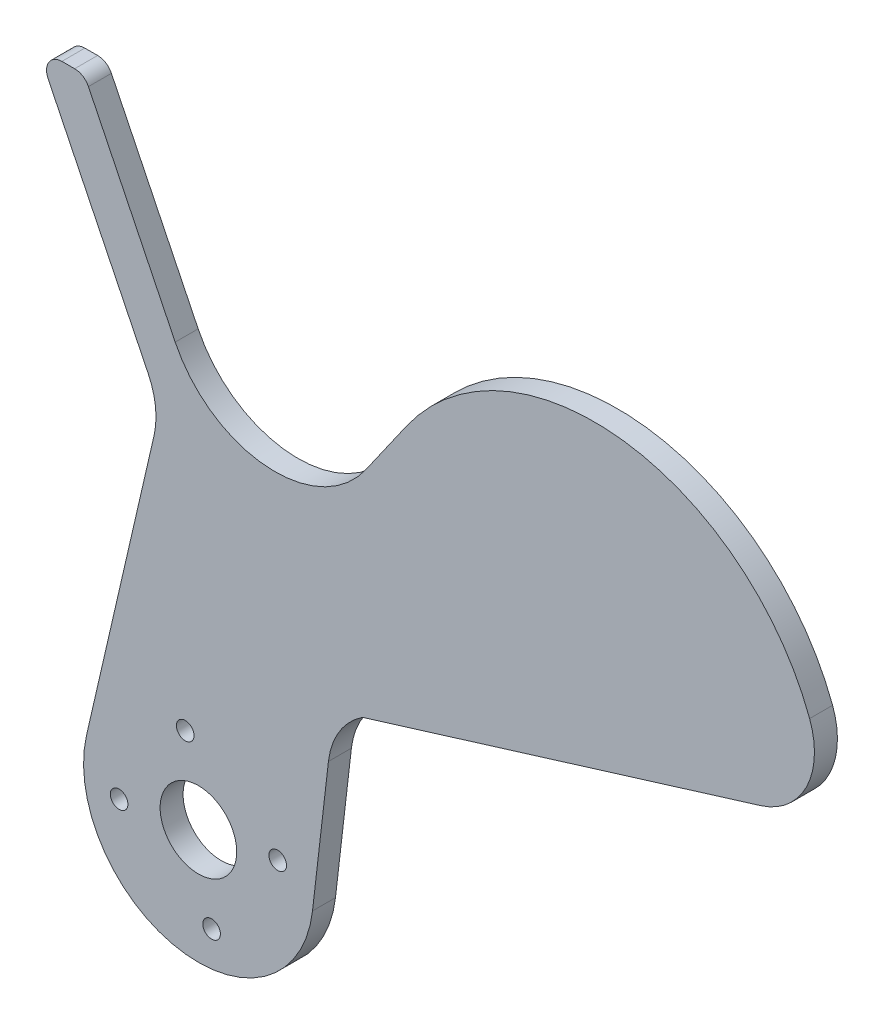
ISO-10303-21;
HEADER;
FILE_DESCRIPTION(('STEP AP214'),'2;1');
FILE_NAME('part.step','',(''),(''),'','','');
FILE_SCHEMA(('AUTOMOTIVE_DESIGN { 1 0 10303 214 1 1 1 1 }'));
ENDSEC;
DATA;
#1=APPLICATION_CONTEXT('core data for automotive mechanical design processes');
#2=APPLICATION_PROTOCOL_DEFINITION('international standard','automotive_design',2000,#1);
#3=PRODUCT_CONTEXT('',#1,'mechanical');
#4=PRODUCT('Part','Part','',(#3));
#5=PRODUCT_RELATED_PRODUCT_CATEGORY('part','',(#4));
#6=PRODUCT_DEFINITION_FORMATION('','',#4);
#7=PRODUCT_DEFINITION_CONTEXT('part definition',#1,'design');
#8=PRODUCT_DEFINITION('design','',#6,#7);
#9=PRODUCT_DEFINITION_SHAPE('','',#8);
#10=(LENGTH_UNIT() NAMED_UNIT(*) SI_UNIT(.MILLI.,.METRE.));
#11=(NAMED_UNIT(*) PLANE_ANGLE_UNIT() SI_UNIT($,.RADIAN.));
#12=(NAMED_UNIT(*) SI_UNIT($,.STERADIAN.) SOLID_ANGLE_UNIT());
#13=UNCERTAINTY_MEASURE_WITH_UNIT(LENGTH_MEASURE(1.E-05),#10,'distance_accuracy_value','');
#14=(GEOMETRIC_REPRESENTATION_CONTEXT(3) GLOBAL_UNCERTAINTY_ASSIGNED_CONTEXT((#13)) GLOBAL_UNIT_ASSIGNED_CONTEXT((#10,
#11,#12)) REPRESENTATION_CONTEXT('',''));
#15=CARTESIAN_POINT('',(0.,0.,0.));
#16=DIRECTION('',(0.,0.,1.));
#17=DIRECTION('',(1.,0.,0.));
#18=AXIS2_PLACEMENT_3D('',#15,#16,#17);
#19=CARTESIAN_POINT('',(-30.1241306273274,-77.2652138906787,3.));
#20=DIRECTION('',(0.,0.,1.));
#21=DIRECTION('',(1.,0.,0.));
#22=AXIS2_PLACEMENT_3D('',#19,#20,#21);
#23=PLANE('',#22);
#24=CARTESIAN_POINT('',(-10.,-60.,3.));
#25=DIRECTION('',(0.,0.,1.));
#26=DIRECTION('',(1.,0.,0.));
#27=AXIS2_PLACEMENT_3D('',#24,#25,#26);
#28=CIRCLE('',#27,5.);
#29=CARTESIAN_POINT('',(-5.,-60.,3.));
#30=VERTEX_POINT('',#29);
#31=EDGE_CURVE('E520',#30,#30,#28,.T.);
#32=ORIENTED_EDGE('',*,*,#31,.F.);
#33=EDGE_LOOP('',(#32));
#34=FACE_BOUND('',#33,.T.);
#35=CARTESIAN_POINT('',(-20.3579106658237,-61.7215361276896,3.));
#36=DIRECTION('',(0.,0.,1.));
#37=DIRECTION('',(1.,0.,0.));
#38=AXIS2_PLACEMENT_3D('',#35,#36,#37);
#39=CIRCLE('',#38,1.15);
#40=CARTESIAN_POINT('',(-19.2079106658237,-61.7215361276896,3.));
#41=VERTEX_POINT('',#40);
#42=EDGE_CURVE('E522',#41,#41,#39,.T.);
#43=ORIENTED_EDGE('',*,*,#42,.F.);
#44=EDGE_LOOP('',(#43));
#45=FACE_BOUND('',#44,.T.);
#46=CARTESIAN_POINT('',(-11.7215361276938,-49.6420893341836,3.));
#47=DIRECTION('',(0.,0.,1.));
#48=DIRECTION('',(1.,0.,0.));
#49=AXIS2_PLACEMENT_3D('',#46,#47,#48);
#50=CIRCLE('',#49,1.15);
#51=CARTESIAN_POINT('',(-10.5715361276938,-49.6420893341836,3.));
#52=VERTEX_POINT('',#51);
#53=EDGE_CURVE('E530',#52,#52,#50,.T.);
#54=ORIENTED_EDGE('',*,*,#53,.F.);
#55=EDGE_LOOP('',(#54));
#56=FACE_BOUND('',#55,.T.);
#57=CARTESIAN_POINT('',(-8.27846387231771,-70.3579106658195,3.));
#58=DIRECTION('',(0.,0.,1.));
#59=DIRECTION('',(1.,0.,0.));
#60=AXIS2_PLACEMENT_3D('',#57,#58,#59);
#61=CIRCLE('',#60,1.15);
#62=CARTESIAN_POINT('',(-7.12846387231771,-70.3579106658195,3.));
#63=VERTEX_POINT('',#62);
#64=EDGE_CURVE('E536',#63,#63,#61,.T.);
#65=ORIENTED_EDGE('',*,*,#64,.F.);
#66=EDGE_LOOP('',(#65));
#67=FACE_BOUND('',#66,.T.);
#68=CARTESIAN_POINT('',(0.357910665812174,-58.2784638723135,3.));
#69=DIRECTION('',(0.,0.,1.));
#70=DIRECTION('',(1.,0.,0.));
#71=AXIS2_PLACEMENT_3D('',#68,#69,#70);
#72=CIRCLE('',#71,1.15);
#73=CARTESIAN_POINT('',(1.50791066581217,-58.2784638723135,3.));
#74=VERTEX_POINT('',#73);
#75=EDGE_CURVE('E178',#74,#74,#72,.T.);
#76=ORIENTED_EDGE('',*,*,#75,.F.);
#77=EDGE_LOOP('',(#76));
#78=FACE_BOUND('',#77,.T.);
#79=DIRECTION('',(-0.955703991120572,-0.294329545503353,0.));
#80=VECTOR('',#79,1.);
#81=CARTESIAN_POINT('',(11.276413219095,-36.6151250652855,3.));
#82=LINE('',#81,#80);
#83=CARTESIAN_POINT('',(63.4009688004772,-20.562250015717,3.));
#84=VERTEX_POINT('',#83);
#85=CARTESIAN_POINT('',(11.4310193454737,-36.5675107921091,3.));
#86=VERTEX_POINT('',#85);
#87=EDGE_CURVE('E152',#84,#86,#82,.T.);
#88=ORIENTED_EDGE('',*,*,#87,.F.);
#89=CARTESIAN_POINT('',(60.4576733454437,-11.0052101045113,3.));
#90=DIRECTION('',(0.,0.,1.));
#91=DIRECTION('',(1.,0.,0.));
#92=AXIS2_PLACEMENT_3D('',#89,#90,#91);
#93=CIRCLE('',#92,10.);
#94=CARTESIAN_POINT('',(69.8261432621106,-7.50781515676704,3.));
#95=VERTEX_POINT('',#94);
#96=EDGE_CURVE('E58',#84,#95,#93,.T.);
#97=ORIENTED_EDGE('',*,*,#96,.T.);
#98=CARTESIAN_POINT('',(41.72073351211,-17.9999999999998,3.));
#99=DIRECTION('',(0.,0.,-1.));
#100=DIRECTION('',(-1.,0.,0.));
#101=AXIS2_PLACEMENT_3D('',#98,#99,#100);
#102=CIRCLE('',#101,29.9999999999999);
#103=CARTESIAN_POINT('',(17.1461721834403,-0.792706909468565,3.));
#104=VERTEX_POINT('',#103);
#105=EDGE_CURVE('E253',#95,#104,#102,.F.);
#106=ORIENTED_EDGE('',*,*,#105,.T.);
#107=DIRECTION('',(-0.573576436351046,-0.819152044288992,0.));
#108=VECTOR('',#107,1.);
#109=CARTESIAN_POINT('',(17.1461721834403,-0.792706909468616,3.));
#110=LINE('',#109,#108);
#111=CARTESIAN_POINT('',(11.8777046421904,-8.31685832709021,3.));
#112=VERTEX_POINT('',#111);
#113=EDGE_CURVE('E250',#104,#112,#110,.T.);
#114=ORIENTED_EDGE('',*,*,#113,.T.);
#115=CARTESIAN_POINT('',(0.,0.,3.));
#116=DIRECTION('',(0.,0.,1.));
#117=DIRECTION('',(1.,0.,0.));
#118=AXIS2_PLACEMENT_3D('',#115,#116,#117);
#119=CIRCLE('',#118,14.4999999999999);
#120=CARTESIAN_POINT('',(-13.0325136713379,-6.35638162844166,3.));
#121=VERTEX_POINT('',#120);
#122=EDGE_CURVE('E247',#112,#121,#119,.F.);
#123=ORIENTED_EDGE('',*,*,#122,.T.);
#124=DIRECTION('',(-0.438371146789079,0.898794046299166,0.));
#125=VECTOR('',#124,1.);
#126=CARTESIAN_POINT('',(-13.0325136713379,-6.35638162844163,3.));
#127=LINE('',#126,#125);
#128=CARTESIAN_POINT('',(-24.3640653422961,16.8767422935782,3.));
#129=VERTEX_POINT('',#128);
#130=EDGE_CURVE('E244',#121,#129,#127,.T.);
#131=ORIENTED_EDGE('',*,*,#130,.T.);
#132=CARTESIAN_POINT('',(-26.1616534348944,16.0000000000002,3.));
#133=DIRECTION('',(0.,0.,-1.));
#134=DIRECTION('',(0.,1.,0.));
#135=AXIS2_PLACEMENT_3D('',#132,#133,#134);
#136=CIRCLE('',#135,1.99999999999988);
#137=CARTESIAN_POINT('',(-26.1616534348944,18.,3.));
#138=VERTEX_POINT('',#137);
#139=EDGE_CURVE('E241',#129,#138,#136,.F.);
#140=ORIENTED_EDGE('',*,*,#139,.T.);
#141=DIRECTION('',(1.,0.,0.));
#142=VECTOR('',#141,1.);
#143=CARTESIAN_POINT('',(-26.9961048902508,18.,3.));
#144=LINE('',#143,#142);
#145=CARTESIAN_POINT('',(-27.8305563456072,18.,3.));
#146=VERTEX_POINT('',#145);
#147=EDGE_CURVE('E151',#146,#138,#144,.T.);
#148=ORIENTED_EDGE('',*,*,#147,.F.);
#149=CARTESIAN_POINT('',(-27.8305563456072,16.0000000000001,3.));
#150=DIRECTION('',(0.,0.,-1.));
#151=DIRECTION('',(0.,1.,0.));
#152=AXIS2_PLACEMENT_3D('',#149,#150,#151);
#153=CIRCLE('',#152,1.99999999999992);
#154=CARTESIAN_POINT('',(-29.6281444382055,15.1232577064219,3.));
#155=VERTEX_POINT('',#154);
#156=EDGE_CURVE('E187',#146,#155,#153,.F.);
#157=ORIENTED_EDGE('',*,*,#156,.T.);
#158=DIRECTION('',(0.438371146789078,-0.898794046299167,0.));
#159=VECTOR('',#158,1.);
#160=CARTESIAN_POINT('',(-29.6281444382055,15.1232577064218,3.));
#161=LINE('',#160,#159);
#162=CARTESIAN_POINT('',(-16.5509641086419,-11.6889353603076,3.));
#163=VERTEX_POINT('',#162);
#164=EDGE_CURVE('E266',#155,#163,#161,.T.);
#165=ORIENTED_EDGE('',*,*,#164,.T.);
#166=CARTESIAN_POINT('',(-25.5389045716334,-16.0726468281983,3.));
#167=DIRECTION('',(0.,0.,1.));
#168=DIRECTION('',(1.,0.,0.));
#169=AXIS2_PLACEMENT_3D('',#166,#167,#168);
#170=CIRCLE('',#169,9.99999999999986);
#171=CARTESIAN_POINT('',(-15.7939381592978,-18.3166676887181,3.));
#172=VERTEX_POINT('',#171);
#173=EDGE_CURVE('E263',#163,#172,#170,.F.);
#174=ORIENTED_EDGE('',*,*,#173,.T.);
#175=DIRECTION('',(-0.224402086051973,-0.974496641233577,0.));
#176=VECTOR('',#175,1.);
#177=CARTESIAN_POINT('',(-15.7939381592978,-18.3166676887181,3.));
#178=LINE('',#177,#176);
#179=CARTESIAN_POINT('',(-24.6174496185037,-56.6339687092204,3.));
#180=VERTEX_POINT('',#179);
#181=EDGE_CURVE('E260',#172,#180,#178,.T.);
#182=ORIENTED_EDGE('',*,*,#181,.T.);
#183=CARTESIAN_POINT('',(-10.0000000000002,-60.,3.));
#184=DIRECTION('',(0.,0.,-1.));
#185=DIRECTION('',(-1.,0.,0.));
#186=AXIS2_PLACEMENT_3D('',#183,#184,#185);
#187=CIRCLE('',#186,14.9999999999999);
#188=CARTESIAN_POINT('',(4.90012437861466,-61.7280895526025,3.));
#189=VERTEX_POINT('',#188);
#190=EDGE_CURVE('E257',#180,#189,#187,.F.);
#191=ORIENTED_EDGE('',*,*,#190,.T.);
#192=DIRECTION('',(0.1152059701735,0.993341625240976,0.));
#193=VECTOR('',#192,1.);
#194=CARTESIAN_POINT('',(4.90012437861468,-61.7280895526026,3.));
#195=LINE('',#194,#193);
#196=CARTESIAN_POINT('',(6.98202004399696,-43.7773390774448,3.));
#197=VERTEX_POINT('',#196);
#198=EDGE_CURVE('E255',#189,#197,#195,.T.);
#199=ORIENTED_EDGE('',*,*,#198,.T.);
#200=CARTESIAN_POINT('',(16.9154362964067,-44.9293987791798,3.));
#201=DIRECTION('',(0.,0.,1.));
#202=DIRECTION('',(1.,0.,0.));
#203=AXIS2_PLACEMENT_3D('',#200,#201,#202);
#204=CIRCLE('',#203,10.);
#205=EDGE_CURVE('E162',#197,#86,#204,.F.);
#206=ORIENTED_EDGE('',*,*,#205,.T.);
#207=EDGE_LOOP('',(#88,#97,#106,#114,#123,#131,#140,#148,#157,#165,#174,#182,#191,#199,#206));
#208=FACE_BOUND('',#207,.T.);
#209=ADVANCED_FACE('F36',(#34,#45,#56,#67,#78,#208),#23,.T.);
#210=CARTESIAN_POINT('',(55.01,-77.2652138906787,0.));
#211=DIRECTION('',(0.,0.,-1.));
#212=DIRECTION('',(-1.,0.,0.));
#213=AXIS2_PLACEMENT_3D('',#210,#211,#212);
#214=PLANE('',#213);
#215=CARTESIAN_POINT('',(-10.,-60.,0.));
#216=DIRECTION('',(0.,0.,1.));
#217=DIRECTION('',(1.,0.,0.));
#218=AXIS2_PLACEMENT_3D('',#215,#216,#217);
#219=CIRCLE('',#218,5.);
#220=CARTESIAN_POINT('',(-5.,-60.,0.));
#221=VERTEX_POINT('',#220);
#222=EDGE_CURVE('E518',#221,#221,#219,.T.);
#223=ORIENTED_EDGE('',*,*,#222,.T.);
#224=EDGE_LOOP('',(#223));
#225=FACE_BOUND('',#224,.T.);
#226=CARTESIAN_POINT('',(-20.3579106658237,-61.7215361276896,0.));
#227=DIRECTION('',(0.,0.,-1.));
#228=DIRECTION('',(-1.,0.,0.));
#229=AXIS2_PLACEMENT_3D('',#226,#227,#228);
#230=CIRCLE('',#229,1.15);
#231=CARTESIAN_POINT('',(-21.5079106658237,-61.7215361276896,0.));
#232=VERTEX_POINT('',#231);
#233=EDGE_CURVE('E527',#232,#232,#230,.T.);
#234=ORIENTED_EDGE('',*,*,#233,.F.);
#235=EDGE_LOOP('',(#234));
#236=FACE_BOUND('',#235,.T.);
#237=CARTESIAN_POINT('',(-11.7215361276938,-49.6420893341836,0.));
#238=DIRECTION('',(0.,0.,-1.));
#239=DIRECTION('',(-1.,0.,0.));
#240=AXIS2_PLACEMENT_3D('',#237,#238,#239);
#241=CIRCLE('',#240,1.15);
#242=CARTESIAN_POINT('',(-12.8715361276938,-49.6420893341836,0.));
#243=VERTEX_POINT('',#242);
#244=EDGE_CURVE('E533',#243,#243,#241,.T.);
#245=ORIENTED_EDGE('',*,*,#244,.F.);
#246=EDGE_LOOP('',(#245));
#247=FACE_BOUND('',#246,.T.);
#248=CARTESIAN_POINT('',(-8.27846387231771,-70.3579106658195,0.));
#249=DIRECTION('',(0.,0.,-1.));
#250=DIRECTION('',(-1.,0.,0.));
#251=AXIS2_PLACEMENT_3D('',#248,#249,#250);
#252=CIRCLE('',#251,1.15);
#253=CARTESIAN_POINT('',(-9.4284638723177,-70.3579106658195,0.));
#254=VERTEX_POINT('',#253);
#255=EDGE_CURVE('E539',#254,#254,#252,.T.);
#256=ORIENTED_EDGE('',*,*,#255,.F.);
#257=EDGE_LOOP('',(#256));
#258=FACE_BOUND('',#257,.T.);
#259=CARTESIAN_POINT('',(0.357910665812174,-58.2784638723135,0.));
#260=DIRECTION('',(0.,0.,-1.));
#261=DIRECTION('',(-1.,0.,0.));
#262=AXIS2_PLACEMENT_3D('',#259,#260,#261);
#263=CIRCLE('',#262,1.15);
#264=CARTESIAN_POINT('',(-0.792089334187824,-58.2784638723135,0.));
#265=VERTEX_POINT('',#264);
#266=EDGE_CURVE('E175',#265,#265,#263,.T.);
#267=ORIENTED_EDGE('',*,*,#266,.F.);
#268=EDGE_LOOP('',(#267));
#269=FACE_BOUND('',#268,.T.);
#270=CARTESIAN_POINT('',(41.72073351211,-17.9999999999998,0.));
#271=DIRECTION('',(0.,0.,-1.));
#272=DIRECTION('',(-1.,0.,0.));
#273=AXIS2_PLACEMENT_3D('',#270,#271,#272);
#274=CIRCLE('',#273,29.9999999999999);
#275=CARTESIAN_POINT('',(17.1461721834403,-0.792706909468564,0.));
#276=VERTEX_POINT('',#275);
#277=CARTESIAN_POINT('',(69.8261432621106,-7.50781515676704,0.));
#278=VERTEX_POINT('',#277);
#279=EDGE_CURVE('E224',#276,#278,#274,.T.);
#280=ORIENTED_EDGE('',*,*,#279,.T.);
#281=CARTESIAN_POINT('',(60.4576733454437,-11.0052101045113,0.));
#282=DIRECTION('',(0.,0.,-1.));
#283=DIRECTION('',(-1.,0.,0.));
#284=AXIS2_PLACEMENT_3D('',#281,#282,#283);
#285=CIRCLE('',#284,10.);
#286=CARTESIAN_POINT('',(63.4009688004772,-20.562250015717,0.));
#287=VERTEX_POINT('',#286);
#288=EDGE_CURVE('E11',#278,#287,#285,.T.);
#289=ORIENTED_EDGE('',*,*,#288,.T.);
#290=DIRECTION('',(-0.955703991120572,-0.294329545503353,0.));
#291=VECTOR('',#290,1.);
#292=CARTESIAN_POINT('',(11.276413219095,-36.6151250652855,0.));
#293=LINE('',#292,#291);
#294=CARTESIAN_POINT('',(11.4310193454737,-36.5675107921091,0.));
#295=VERTEX_POINT('',#294);
#296=EDGE_CURVE('E141',#287,#295,#293,.T.);
#297=ORIENTED_EDGE('',*,*,#296,.T.);
#298=CARTESIAN_POINT('',(16.9154362964067,-44.9293987791798,0.));
#299=DIRECTION('',(0.,0.,-1.));
#300=DIRECTION('',(-1.,0.,0.));
#301=AXIS2_PLACEMENT_3D('',#298,#299,#300);
#302=CIRCLE('',#301,10.);
#303=CARTESIAN_POINT('',(6.98202004399696,-43.7773390774448,0.));
#304=VERTEX_POINT('',#303);
#305=EDGE_CURVE('E144',#295,#304,#302,.F.);
#306=ORIENTED_EDGE('',*,*,#305,.T.);
#307=DIRECTION('',(-0.1152059701735,-0.993341625240975,0.));
#308=VECTOR('',#307,1.);
#309=CARTESIAN_POINT('',(7.52075674677589,-39.1321840467684,0.));
#310=LINE('',#309,#308);
#311=CARTESIAN_POINT('',(4.90012437861466,-61.7280895526025,0.));
#312=VERTEX_POINT('',#311);
#313=EDGE_CURVE('E222',#304,#312,#310,.T.);
#314=ORIENTED_EDGE('',*,*,#313,.T.);
#315=CARTESIAN_POINT('',(-10.0000000000002,-60.,0.));
#316=DIRECTION('',(0.,0.,-1.));
#317=DIRECTION('',(-1.,0.,0.));
#318=AXIS2_PLACEMENT_3D('',#315,#316,#317);
#319=CIRCLE('',#318,14.9999999999999);
#320=CARTESIAN_POINT('',(-24.6174496185037,-56.6339687092204,0.));
#321=VERTEX_POINT('',#320);
#322=EDGE_CURVE('E219',#312,#321,#319,.T.);
#323=ORIENTED_EDGE('',*,*,#322,.T.);
#324=DIRECTION('',(0.224402086051973,0.974496641233577,0.));
#325=VECTOR('',#324,1.);
#326=CARTESIAN_POINT('',(-24.6174496185037,-56.6339687092204,0.));
#327=LINE('',#326,#325);
#328=CARTESIAN_POINT('',(-15.7939381592978,-18.3166676887181,0.));
#329=VERTEX_POINT('',#328);
#330=EDGE_CURVE('E216',#321,#329,#327,.T.);
#331=ORIENTED_EDGE('',*,*,#330,.T.);
#332=CARTESIAN_POINT('',(-25.5389045716334,-16.0726468281983,0.));
#333=DIRECTION('',(0.,0.,1.));
#334=DIRECTION('',(1.,0.,0.));
#335=AXIS2_PLACEMENT_3D('',#332,#333,#334);
#336=CIRCLE('',#335,9.99999999999986);
#337=CARTESIAN_POINT('',(-16.5509641086419,-11.6889353603076,0.));
#338=VERTEX_POINT('',#337);
#339=EDGE_CURVE('E213',#329,#338,#336,.T.);
#340=ORIENTED_EDGE('',*,*,#339,.T.);
#341=DIRECTION('',(-0.438371146789078,0.898794046299167,0.));
#342=VECTOR('',#341,1.);
#343=CARTESIAN_POINT('',(-16.5509641086419,-11.6889353603076,0.));
#344=LINE('',#343,#342);
#345=CARTESIAN_POINT('',(-29.6281444382055,15.1232577064219,0.));
#346=VERTEX_POINT('',#345);
#347=EDGE_CURVE('E168',#338,#346,#344,.T.);
#348=ORIENTED_EDGE('',*,*,#347,.T.);
#349=CARTESIAN_POINT('',(-27.8305563456072,16.0000000000001,0.));
#350=DIRECTION('',(0.,0.,-1.));
#351=DIRECTION('',(0.,1.,0.));
#352=AXIS2_PLACEMENT_3D('',#349,#350,#351);
#353=CIRCLE('',#352,1.99999999999992);
#354=CARTESIAN_POINT('',(-27.8305563456072,18.,0.));
#355=VERTEX_POINT('',#354);
#356=EDGE_CURVE('E238',#346,#355,#353,.T.);
#357=ORIENTED_EDGE('',*,*,#356,.T.);
#358=DIRECTION('',(-1.,0.,0.));
#359=VECTOR('',#358,1.);
#360=CARTESIAN_POINT('',(-26.9961048902508,18.,0.));
#361=LINE('',#360,#359);
#362=CARTESIAN_POINT('',(-26.1616534348944,18.,0.));
#363=VERTEX_POINT('',#362);
#364=EDGE_CURVE('E208',#363,#355,#361,.T.);
#365=ORIENTED_EDGE('',*,*,#364,.F.);
#366=CARTESIAN_POINT('',(-26.1616534348944,16.0000000000002,0.));
#367=DIRECTION('',(0.,0.,-1.));
#368=DIRECTION('',(0.,1.,0.));
#369=AXIS2_PLACEMENT_3D('',#366,#367,#368);
#370=CIRCLE('',#369,1.99999999999988);
#371=CARTESIAN_POINT('',(-24.3640653422961,16.8767422935782,0.));
#372=VERTEX_POINT('',#371);
#373=EDGE_CURVE('E235',#363,#372,#370,.T.);
#374=ORIENTED_EDGE('',*,*,#373,.T.);
#375=DIRECTION('',(0.438371146789079,-0.898794046299166,0.));
#376=VECTOR('',#375,1.);
#377=CARTESIAN_POINT('',(-24.3640653422961,16.8767422935782,0.));
#378=LINE('',#377,#376);
#379=CARTESIAN_POINT('',(-13.0325136713379,-6.35638162844166,0.));
#380=VERTEX_POINT('',#379);
#381=EDGE_CURVE('E232',#372,#380,#378,.T.);
#382=ORIENTED_EDGE('',*,*,#381,.T.);
#383=CARTESIAN_POINT('',(0.,0.,0.));
#384=DIRECTION('',(0.,0.,1.));
#385=DIRECTION('',(1.,0.,0.));
#386=AXIS2_PLACEMENT_3D('',#383,#384,#385);
#387=CIRCLE('',#386,14.4999999999999);
#388=CARTESIAN_POINT('',(11.8777046421904,-8.31685832709022,0.));
#389=VERTEX_POINT('',#388);
#390=EDGE_CURVE('E229',#380,#389,#387,.T.);
#391=ORIENTED_EDGE('',*,*,#390,.T.);
#392=DIRECTION('',(0.573576436351047,0.819152044288991,0.));
#393=VECTOR('',#392,1.);
#394=CARTESIAN_POINT('',(11.8777046421904,-8.31685832709017,0.));
#395=LINE('',#394,#393);
#396=EDGE_CURVE('E226',#389,#276,#395,.T.);
#397=ORIENTED_EDGE('',*,*,#396,.T.);
#398=EDGE_LOOP('',(#280,#289,#297,#306,#314,#323,#331,#340,#348,#357,#365,#374,#382,#391,#397));
#399=FACE_BOUND('',#398,.T.);
#400=ADVANCED_FACE('F143',(#225,#236,#247,#258,#269,#399),#214,.T.);
#401=CARTESIAN_POINT('',(-26.1516534348944,18.,-0.01));
#402=DIRECTION('',(0.,1.,0.));
#403=DIRECTION('',(-1.,0.,0.));
#404=AXIS2_PLACEMENT_3D('',#401,#402,#403);
#405=PLANE('',#404);
#406=DIRECTION('',(0.,0.,1.));
#407=VECTOR('',#406,1.);
#408=CARTESIAN_POINT('',(-26.1616534348944,18.,1.5));
#409=LINE('',#408,#407);
#410=EDGE_CURVE('E202',#363,#138,#409,.T.);
#411=ORIENTED_EDGE('',*,*,#410,.F.);
#412=ORIENTED_EDGE('',*,*,#364,.T.);
#413=DIRECTION('',(0.,0.,-1.));
#414=VECTOR('',#413,1.);
#415=CARTESIAN_POINT('',(-27.8305563456072,18.,1.5));
#416=LINE('',#415,#414);
#417=EDGE_CURVE('E205',#146,#355,#416,.T.);
#418=ORIENTED_EDGE('',*,*,#417,.F.);
#419=ORIENTED_EDGE('',*,*,#147,.T.);
#420=EDGE_LOOP('',(#411,#412,#418,#419));
#421=FACE_BOUND('',#420,.T.);
#422=ADVANCED_FACE('F296',(#421),#405,.T.);
#423=CARTESIAN_POINT('',(-27.8305563456072,16.0000000000001,3.));
#424=DIRECTION('',(0.,0.,-1.));
#425=DIRECTION('',(0.,1.,0.));
#426=AXIS2_PLACEMENT_3D('',#423,#424,#425);
#427=CYLINDRICAL_SURFACE('',#426,1.99999999999992);
#428=ORIENTED_EDGE('',*,*,#356,.F.);
#429=DIRECTION('',(0.,0.,-1.));
#430=VECTOR('',#429,1.);
#431=CARTESIAN_POINT('',(-29.6281444382055,15.1232577064218,1.5));
#432=LINE('',#431,#430);
#433=EDGE_CURVE('E183',#155,#346,#432,.T.);
#434=ORIENTED_EDGE('',*,*,#433,.F.);
#435=ORIENTED_EDGE('',*,*,#156,.F.);
#436=ORIENTED_EDGE('',*,*,#417,.T.);
#437=EDGE_LOOP('',(#428,#434,#435,#436));
#438=FACE_BOUND('',#437,.T.);
#439=ADVANCED_FACE('F273',(#438),#427,.T.);
#440=CARTESIAN_POINT('',(-26.1616534348944,16.0000000000002,3.));
#441=DIRECTION('',(0.,0.,-1.));
#442=DIRECTION('',(0.,1.,0.));
#443=AXIS2_PLACEMENT_3D('',#440,#441,#442);
#444=CYLINDRICAL_SURFACE('',#443,1.99999999999988);
#445=ORIENTED_EDGE('',*,*,#373,.F.);
#446=ORIENTED_EDGE('',*,*,#410,.T.);
#447=ORIENTED_EDGE('',*,*,#139,.F.);
#448=DIRECTION('',(0.,0.,1.));
#449=VECTOR('',#448,1.);
#450=CARTESIAN_POINT('',(-24.3640653422961,16.8767422935782,1.5));
#451=LINE('',#450,#449);
#452=EDGE_CURVE('E200',#372,#129,#451,.T.);
#453=ORIENTED_EDGE('',*,*,#452,.F.);
#454=EDGE_LOOP('',(#445,#446,#447,#453));
#455=FACE_BOUND('',#454,.T.);
#456=ADVANCED_FACE('F299',(#455),#444,.T.);
#457=CARTESIAN_POINT('',(-13.02812995987,-6.36536956890461,-0.01));
#458=DIRECTION('',(0.898794046299166,0.438371146789081,0.));
#459=DIRECTION('',(-0.438371146789081,0.898794046299166,0.));
#460=AXIS2_PLACEMENT_3D('',#457,#458,#459);
#461=PLANE('',#460);
#462=DIRECTION('',(0.,0.,1.));
#463=VECTOR('',#462,1.);
#464=CARTESIAN_POINT('',(-13.0325136713379,-6.35638162844162,1.5));
#465=LINE('',#464,#463);
#466=EDGE_CURVE('E198',#380,#121,#465,.T.);
#467=ORIENTED_EDGE('',*,*,#466,.F.);
#468=ORIENTED_EDGE('',*,*,#381,.F.);
#469=ORIENTED_EDGE('',*,*,#452,.T.);
#470=ORIENTED_EDGE('',*,*,#130,.F.);
#471=EDGE_LOOP('',(#467,#468,#469,#470));
#472=FACE_BOUND('',#471,.T.);
#473=ADVANCED_FACE('F303',(#472),#461,.T.);
#474=CARTESIAN_POINT('',(0.,0.,0.));
#475=DIRECTION('',(0.,0.,1.));
#476=DIRECTION('',(1.,0.,0.));
#477=AXIS2_PLACEMENT_3D('',#474,#475,#476);
#478=CYLINDRICAL_SURFACE('',#477,14.4999999999999);
#479=ORIENTED_EDGE('',*,*,#122,.F.);
#480=DIRECTION('',(0.,0.,1.));
#481=VECTOR('',#480,1.);
#482=CARTESIAN_POINT('',(11.8777046421904,-8.31685832709017,1.5));
#483=LINE('',#482,#481);
#484=EDGE_CURVE('E196',#389,#112,#483,.T.);
#485=ORIENTED_EDGE('',*,*,#484,.F.);
#486=ORIENTED_EDGE('',*,*,#390,.F.);
#487=ORIENTED_EDGE('',*,*,#466,.T.);
#488=EDGE_LOOP('',(#479,#485,#486,#487));
#489=FACE_BOUND('',#488,.T.);
#490=ADVANCED_FACE('F308',(#489),#478,.F.);
#491=CARTESIAN_POINT('',(17.1519079478038,-0.784515389025722,-0.01));
#492=DIRECTION('',(-0.819152044288992,0.573576436351045,0.));
#493=DIRECTION('',(-0.573576436351045,-0.819152044288992,0.));
#494=AXIS2_PLACEMENT_3D('',#491,#492,#493);
#495=PLANE('',#494);
#496=ORIENTED_EDGE('',*,*,#484,.T.);
#497=ORIENTED_EDGE('',*,*,#113,.F.);
#498=DIRECTION('',(0.,0.,1.));
#499=VECTOR('',#498,1.);
#500=CARTESIAN_POINT('',(17.1461721834403,-0.792706909468617,1.5));
#501=LINE('',#500,#499);
#502=EDGE_CURVE('E193',#276,#104,#501,.T.);
#503=ORIENTED_EDGE('',*,*,#502,.F.);
#504=ORIENTED_EDGE('',*,*,#396,.F.);
#505=EDGE_LOOP('',(#496,#497,#503,#504));
#506=FACE_BOUND('',#505,.T.);
#507=ADVANCED_FACE('F311',(#506),#495,.T.);
#508=CARTESIAN_POINT('',(41.72073351211,-17.9999999999998,3.));
#509=DIRECTION('',(0.,0.,-1.));
#510=DIRECTION('',(-1.,0.,0.));
#511=AXIS2_PLACEMENT_3D('',#508,#509,#510);
#512=CYLINDRICAL_SURFACE('',#511,29.9999999999999);
#513=ORIENTED_EDGE('',*,*,#105,.F.);
#514=DIRECTION('',(0.,0.,-1.));
#515=VECTOR('',#514,1.);
#516=CARTESIAN_POINT('',(69.8261432621106,-7.50781515676704,3.));
#517=LINE('',#516,#515);
#518=EDGE_CURVE('E44',#95,#278,#517,.T.);
#519=ORIENTED_EDGE('',*,*,#518,.T.);
#520=ORIENTED_EDGE('',*,*,#279,.F.);
#521=ORIENTED_EDGE('',*,*,#502,.T.);
#522=EDGE_LOOP('',(#513,#519,#520,#521));
#523=FACE_BOUND('',#522,.T.);
#524=ADVANCED_FACE('F312',(#523),#512,.T.);
#525=CARTESIAN_POINT('',(4.89897231891294,-61.738022968855,-0.01));
#526=DIRECTION('',(0.993341625240976,-0.1152059701735,0.));
#527=DIRECTION('',(0.1152059701735,0.993341625240976,0.));
#528=AXIS2_PLACEMENT_3D('',#525,#526,#527);
#529=PLANE('',#528);
#530=ORIENTED_EDGE('',*,*,#313,.F.);
#531=DIRECTION('',(0.,0.,1.));
#532=VECTOR('',#531,1.);
#533=CARTESIAN_POINT('',(6.98202004399695,-43.7773390774448,3.));
#534=LINE('',#533,#532);
#535=EDGE_CURVE('E160',#304,#197,#534,.T.);
#536=ORIENTED_EDGE('',*,*,#535,.T.);
#537=ORIENTED_EDGE('',*,*,#198,.F.);
#538=DIRECTION('',(0.,0.,1.));
#539=VECTOR('',#538,1.);
#540=CARTESIAN_POINT('',(4.90012437861463,-61.7280895526026,1.5));
#541=LINE('',#540,#539);
#542=EDGE_CURVE('E191',#312,#189,#541,.T.);
#543=ORIENTED_EDGE('',*,*,#542,.F.);
#544=EDGE_LOOP('',(#530,#536,#537,#543));
#545=FACE_BOUND('',#544,.T.);
#546=ADVANCED_FACE('F292',(#545),#529,.T.);
#547=CARTESIAN_POINT('',(-10.0000000000002,-60.,3.));
#548=DIRECTION('',(0.,0.,-1.));
#549=DIRECTION('',(-1.,0.,0.));
#550=AXIS2_PLACEMENT_3D('',#547,#548,#549);
#551=CYLINDRICAL_SURFACE('',#550,14.9999999999999);
#552=ORIENTED_EDGE('',*,*,#190,.F.);
#553=DIRECTION('',(0.,0.,1.));
#554=VECTOR('',#553,1.);
#555=CARTESIAN_POINT('',(-24.6174496185037,-56.6339687092204,1.5));
#556=LINE('',#555,#554);
#557=EDGE_CURVE('E189',#321,#180,#556,.T.);
#558=ORIENTED_EDGE('',*,*,#557,.F.);
#559=ORIENTED_EDGE('',*,*,#322,.F.);
#560=ORIENTED_EDGE('',*,*,#542,.T.);
#561=EDGE_LOOP('',(#552,#558,#559,#560));
#562=FACE_BOUND('',#561,.T.);
#563=ADVANCED_FACE('F288',(#562),#551,.T.);
#564=CARTESIAN_POINT('',(-15.7916941384373,-18.3069227223058,-0.01));
#565=DIRECTION('',(-0.974496641233577,0.224402086051972,0.));
#566=DIRECTION('',(-0.224402086051972,-0.974496641233577,0.));
#567=AXIS2_PLACEMENT_3D('',#564,#565,#566);
#568=PLANE('',#567);
#569=ORIENTED_EDGE('',*,*,#557,.T.);
#570=ORIENTED_EDGE('',*,*,#181,.F.);
#571=DIRECTION('',(0.,0.,1.));
#572=VECTOR('',#571,1.);
#573=CARTESIAN_POINT('',(-15.7939381592978,-18.3166676887181,1.5));
#574=LINE('',#573,#572);
#575=EDGE_CURVE('E184',#329,#172,#574,.T.);
#576=ORIENTED_EDGE('',*,*,#575,.F.);
#577=ORIENTED_EDGE('',*,*,#330,.F.);
#578=EDGE_LOOP('',(#569,#570,#576,#577));
#579=FACE_BOUND('',#578,.T.);
#580=ADVANCED_FACE('F284',(#579),#568,.T.);
#581=CARTESIAN_POINT('',(-25.5389045716334,-16.0726468281983,0.));
#582=DIRECTION('',(0.,0.,1.));
#583=DIRECTION('',(1.,0.,0.));
#584=AXIS2_PLACEMENT_3D('',#581,#582,#583);
#585=CYLINDRICAL_SURFACE('',#584,9.99999999999986);
#586=ORIENTED_EDGE('',*,*,#173,.F.);
#587=DIRECTION('',(0.,0.,1.));
#588=VECTOR('',#587,1.);
#589=CARTESIAN_POINT('',(-16.5509641086419,-11.6889353603076,1.5));
#590=LINE('',#589,#588);
#591=EDGE_CURVE('E181',#338,#163,#590,.T.);
#592=ORIENTED_EDGE('',*,*,#591,.F.);
#593=ORIENTED_EDGE('',*,*,#339,.F.);
#594=ORIENTED_EDGE('',*,*,#575,.T.);
#595=EDGE_LOOP('',(#586,#592,#593,#594));
#596=FACE_BOUND('',#595,.T.);
#597=ADVANCED_FACE('F280',(#596),#585,.F.);
#598=CARTESIAN_POINT('',(-29.6325281496734,15.1322456468848,-0.01));
#599=DIRECTION('',(-0.898794046299166,-0.438371146789079,0.));
#600=DIRECTION('',(0.438371146789079,-0.898794046299166,0.));
#601=AXIS2_PLACEMENT_3D('',#598,#599,#600);
#602=PLANE('',#601);
#603=ORIENTED_EDGE('',*,*,#433,.T.);
#604=ORIENTED_EDGE('',*,*,#347,.F.);
#605=ORIENTED_EDGE('',*,*,#591,.T.);
#606=ORIENTED_EDGE('',*,*,#164,.F.);
#607=EDGE_LOOP('',(#603,#604,#605,#606));
#608=FACE_BOUND('',#607,.T.);
#609=ADVANCED_FACE('F276',(#608),#602,.T.);
#610=CARTESIAN_POINT('',(16.9154362964067,-44.9293987791798,-0.01));
#611=DIRECTION('',(0.,0.,-1.));
#612=DIRECTION('',(-1.,0.,0.));
#613=AXIS2_PLACEMENT_3D('',#610,#611,#612);
#614=CYLINDRICAL_SURFACE('',#613,10.);
#615=ORIENTED_EDGE('',*,*,#305,.F.);
#616=DIRECTION('',(0.,0.,1.));
#617=VECTOR('',#616,1.);
#618=CARTESIAN_POINT('',(11.4310193454737,-36.5675107921091,0.));
#619=LINE('',#618,#617);
#620=EDGE_CURVE('E158',#86,#295,#619,.F.);
#621=ORIENTED_EDGE('',*,*,#620,.F.);
#622=ORIENTED_EDGE('',*,*,#205,.F.);
#623=ORIENTED_EDGE('',*,*,#535,.F.);
#624=EDGE_LOOP('',(#615,#621,#622,#623));
#625=FACE_BOUND('',#624,.T.);
#626=ADVANCED_FACE('F157',(#625),#614,.F.);
#627=CARTESIAN_POINT('',(11.276413219095,-36.6151250652855,0.));
#628=DIRECTION('',(-0.294329545503353,0.955703991120572,0.));
#629=DIRECTION('',(-0.955703991120572,-0.294329545503353,0.));
#630=AXIS2_PLACEMENT_3D('',#627,#628,#629);
#631=PLANE('',#630);
#632=ORIENTED_EDGE('',*,*,#296,.F.);
#633=DIRECTION('',(0.,0.,1.));
#634=VECTOR('',#633,1.);
#635=CARTESIAN_POINT('',(63.4009688004772,-20.562250015717,3.));
#636=LINE('',#635,#634);
#637=EDGE_CURVE('E161',#287,#84,#636,.T.);
#638=ORIENTED_EDGE('',*,*,#637,.T.);
#639=ORIENTED_EDGE('',*,*,#87,.T.);
#640=ORIENTED_EDGE('',*,*,#620,.T.);
#641=EDGE_LOOP('',(#632,#638,#639,#640));
#642=FACE_BOUND('',#641,.T.);
#643=ADVANCED_FACE('F164',(#642),#631,.F.);
#644=CARTESIAN_POINT('',(60.4576733454437,-11.0052101045113,3.));
#645=DIRECTION('',(0.,0.,-1.));
#646=DIRECTION('',(-1.,0.,0.));
#647=AXIS2_PLACEMENT_3D('',#644,#645,#646);
#648=CYLINDRICAL_SURFACE('',#647,10.);
#649=ORIENTED_EDGE('',*,*,#288,.F.);
#650=ORIENTED_EDGE('',*,*,#518,.F.);
#651=ORIENTED_EDGE('',*,*,#96,.F.);
#652=ORIENTED_EDGE('',*,*,#637,.F.);
#653=EDGE_LOOP('',(#649,#650,#651,#652));
#654=FACE_BOUND('',#653,.T.);
#655=ADVANCED_FACE('F38',(#654),#648,.T.);
#656=CARTESIAN_POINT('',(0.357910665812174,-58.2784638723135,3.));
#657=DIRECTION('',(0.,0.,1.));
#658=DIRECTION('',(1.,0.,0.));
#659=AXIS2_PLACEMENT_3D('',#656,#657,#658);
#660=CYLINDRICAL_SURFACE('',#659,1.15);
#661=ORIENTED_EDGE('',*,*,#266,.T.);
#662=EDGE_LOOP('',(#661));
#663=FACE_BOUND('',#662,.T.);
#664=ORIENTED_EDGE('',*,*,#75,.T.);
#665=EDGE_LOOP('',(#664));
#666=FACE_BOUND('',#665,.T.);
#667=ADVANCED_FACE('F314',(#663,#666),#660,.F.);
#668=CARTESIAN_POINT('',(-8.27846387231771,-70.3579106658195,3.));
#669=DIRECTION('',(0.,0.,1.));
#670=DIRECTION('',(1.,0.,0.));
#671=AXIS2_PLACEMENT_3D('',#668,#669,#670);
#672=CYLINDRICAL_SURFACE('',#671,1.15);
#673=ORIENTED_EDGE('',*,*,#255,.T.);
#674=EDGE_LOOP('',(#673));
#675=FACE_BOUND('',#674,.T.);
#676=ORIENTED_EDGE('',*,*,#64,.T.);
#677=EDGE_LOOP('',(#676));
#678=FACE_BOUND('',#677,.T.);
#679=ADVANCED_FACE('F319',(#675,#678),#672,.F.);
#680=CARTESIAN_POINT('',(-11.7215361276938,-49.6420893341836,3.));
#681=DIRECTION('',(0.,0.,1.));
#682=DIRECTION('',(1.,0.,0.));
#683=AXIS2_PLACEMENT_3D('',#680,#681,#682);
#684=CYLINDRICAL_SURFACE('',#683,1.15);
#685=ORIENTED_EDGE('',*,*,#244,.T.);
#686=EDGE_LOOP('',(#685));
#687=FACE_BOUND('',#686,.T.);
#688=ORIENTED_EDGE('',*,*,#53,.T.);
#689=EDGE_LOOP('',(#688));
#690=FACE_BOUND('',#689,.T.);
#691=ADVANCED_FACE('F470',(#687,#690),#684,.F.);
#692=CARTESIAN_POINT('',(-20.3579106658237,-61.7215361276896,3.));
#693=DIRECTION('',(0.,0.,1.));
#694=DIRECTION('',(1.,0.,0.));
#695=AXIS2_PLACEMENT_3D('',#692,#693,#694);
#696=CYLINDRICAL_SURFACE('',#695,1.15);
#697=ORIENTED_EDGE('',*,*,#233,.T.);
#698=EDGE_LOOP('',(#697));
#699=FACE_BOUND('',#698,.T.);
#700=ORIENTED_EDGE('',*,*,#42,.T.);
#701=EDGE_LOOP('',(#700));
#702=FACE_BOUND('',#701,.T.);
#703=ADVANCED_FACE('F464',(#699,#702),#696,.F.);
#704=CARTESIAN_POINT('',(-10.,-60.,0.));
#705=DIRECTION('',(0.,0.,1.));
#706=DIRECTION('',(1.,0.,0.));
#707=AXIS2_PLACEMENT_3D('',#704,#705,#706);
#708=CYLINDRICAL_SURFACE('',#707,5.);
#709=ORIENTED_EDGE('',*,*,#222,.F.);
#710=EDGE_LOOP('',(#709));
#711=FACE_BOUND('',#710,.T.);
#712=ORIENTED_EDGE('',*,*,#31,.T.);
#713=EDGE_LOOP('',(#712));
#714=FACE_BOUND('',#713,.T.);
#715=ADVANCED_FACE('F469',(#711,#714),#708,.F.);
#716=CLOSED_SHELL('',(#209,#400,#422,#439,#456,#473,#490,#507,#524,#546,#563,#580,#597,#609,
#626,#643,#655,#667,#679,#691,#703,#715));
#717=MANIFOLD_SOLID_BREP('B2',#716);
#718=ADVANCED_BREP_SHAPE_REPRESENTATION('',(#18,#717),#14);
#719=SHAPE_DEFINITION_REPRESENTATION(#9,#718);
ENDSEC;
END-ISO-10303-21;
